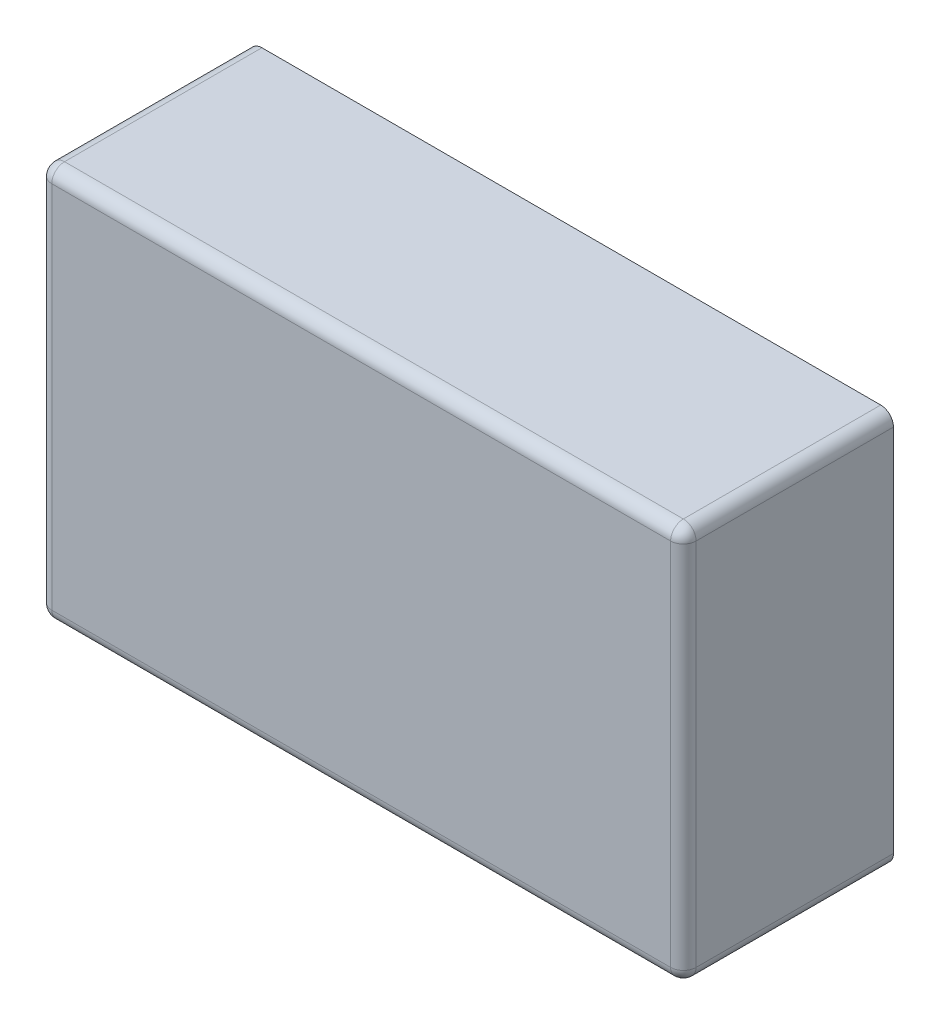
ISO-10303-21;
HEADER;
FILE_DESCRIPTION(('STEP AP214'),'2;1');
FILE_NAME('part.step','',(''),(''),'','','');
FILE_SCHEMA(('AUTOMOTIVE_DESIGN { 1 0 10303 214 1 1 1 1 }'));
ENDSEC;
DATA;
#1=APPLICATION_CONTEXT('core data for automotive mechanical design processes');
#2=APPLICATION_PROTOCOL_DEFINITION('international standard','automotive_design',2000,#1);
#3=PRODUCT_CONTEXT('',#1,'mechanical');
#4=PRODUCT('Part','Part','',(#3));
#5=PRODUCT_RELATED_PRODUCT_CATEGORY('part','',(#4));
#6=PRODUCT_DEFINITION_FORMATION('','',#4);
#7=PRODUCT_DEFINITION_CONTEXT('part definition',#1,'design');
#8=PRODUCT_DEFINITION('design','',#6,#7);
#9=PRODUCT_DEFINITION_SHAPE('','',#8);
#10=(LENGTH_UNIT() NAMED_UNIT(*) SI_UNIT(.MILLI.,.METRE.));
#11=(NAMED_UNIT(*) PLANE_ANGLE_UNIT() SI_UNIT($,.RADIAN.));
#12=(NAMED_UNIT(*) SI_UNIT($,.STERADIAN.) SOLID_ANGLE_UNIT());
#13=UNCERTAINTY_MEASURE_WITH_UNIT(LENGTH_MEASURE(1.E-05),#10,'distance_accuracy_value','');
#14=(GEOMETRIC_REPRESENTATION_CONTEXT(3) GLOBAL_UNCERTAINTY_ASSIGNED_CONTEXT((#13)) GLOBAL_UNIT_ASSIGNED_CONTEXT((#10,
#11,#12)) REPRESENTATION_CONTEXT('',''));
#15=CARTESIAN_POINT('',(0.,0.,0.));
#16=DIRECTION('',(0.,0.,1.));
#17=DIRECTION('',(1.,0.,0.));
#18=AXIS2_PLACEMENT_3D('',#15,#16,#17);
#19=CARTESIAN_POINT('',(0.,0.,82.5));
#20=DIRECTION('',(-1.,0.,0.));
#21=DIRECTION('',(0.,0.,1.));
#22=AXIS2_PLACEMENT_3D('',#19,#20,#21);
#23=PLANE('',#22);
#24=DIRECTION('',(0.,1.,0.));
#25=VECTOR('',#24,1.);
#26=CARTESIAN_POINT('',(0.,20.5,45.));
#27=LINE('',#26,#25);
#28=CARTESIAN_POINT('',(0.,20.5,45.));
#29=VERTEX_POINT('',#28);
#30=CARTESIAN_POINT('',(0.,134.5,45.));
#31=VERTEX_POINT('',#30);
#32=EDGE_CURVE('E200',#29,#31,#27,.T.);
#33=ORIENTED_EDGE('',*,*,#32,.F.);
#34=DIRECTION('',(0.,0.,1.));
#35=VECTOR('',#34,1.);
#36=CARTESIAN_POINT('',(0.,20.5,0.));
#37=LINE('',#36,#35);
#38=CARTESIAN_POINT('',(0.,20.5,0.));
#39=VERTEX_POINT('',#38);
#40=EDGE_CURVE('E208',#39,#29,#37,.T.);
#41=ORIENTED_EDGE('',*,*,#40,.F.);
#42=DIRECTION('',(0.,1.,0.));
#43=VECTOR('',#42,1.);
#44=CARTESIAN_POINT('',(0.,0.,0.));
#45=LINE('',#44,#43);
#46=CARTESIAN_POINT('',(0.,5.,0.));
#47=VERTEX_POINT('',#46);
#48=EDGE_CURVE('E303',#47,#39,#45,.T.);
#49=ORIENTED_EDGE('',*,*,#48,.F.);
#50=DIRECTION('',(0.,0.,-1.));
#51=VECTOR('',#50,1.);
#52=CARTESIAN_POINT('',(0.,5.,82.5));
#53=LINE('',#52,#51);
#54=CARTESIAN_POINT('',(0.,5.,77.5));
#55=VERTEX_POINT('',#54);
#56=EDGE_CURVE('E307',#47,#55,#53,.F.);
#57=ORIENTED_EDGE('',*,*,#56,.T.);
#58=DIRECTION('',(0.,1.,0.));
#59=VECTOR('',#58,1.);
#60=CARTESIAN_POINT('',(0.,0.,77.5));
#61=LINE('',#60,#59);
#62=CARTESIAN_POINT('',(0.,150.,77.5));
#63=VERTEX_POINT('',#62);
#64=EDGE_CURVE('E305',#55,#63,#61,.T.);
#65=ORIENTED_EDGE('',*,*,#64,.T.);
#66=DIRECTION('',(0.,0.,-1.));
#67=VECTOR('',#66,1.);
#68=CARTESIAN_POINT('',(0.,150.,82.5));
#69=LINE('',#68,#67);
#70=CARTESIAN_POINT('',(0.,150.,0.));
#71=VERTEX_POINT('',#70);
#72=EDGE_CURVE('E309',#63,#71,#69,.T.);
#73=ORIENTED_EDGE('',*,*,#72,.T.);
#74=CARTESIAN_POINT('',(0.,134.5,0.));
#75=VERTEX_POINT('',#74);
#76=EDGE_CURVE('E302',#75,#71,#45,.T.);
#77=ORIENTED_EDGE('',*,*,#76,.F.);
#78=DIRECTION('',(0.,0.,1.));
#79=VECTOR('',#78,1.);
#80=CARTESIAN_POINT('',(0.,134.5,0.));
#81=LINE('',#80,#79);
#82=EDGE_CURVE('E217',#75,#31,#81,.T.);
#83=ORIENTED_EDGE('',*,*,#82,.T.);
#84=EDGE_LOOP('',(#33,#41,#49,#57,#65,#73,#77,#83));
#85=FACE_BOUND('',#84,.T.);
#86=ADVANCED_FACE('F34',(#85),#23,.T.);
#87=CARTESIAN_POINT('',(0.,0.,82.5));
#88=DIRECTION('',(0.,1.,0.));
#89=DIRECTION('',(0.,0.,1.));
#90=AXIS2_PLACEMENT_3D('',#87,#88,#89);
#91=PLANE('',#90);
#92=DIRECTION('',(1.,0.,0.));
#93=VECTOR('',#92,1.);
#94=CARTESIAN_POINT('',(0.,0.,0.));
#95=LINE('',#94,#93);
#96=CARTESIAN_POINT('',(5.,0.,0.));
#97=VERTEX_POINT('',#96);
#98=CARTESIAN_POINT('',(248.,0.,0.));
#99=VERTEX_POINT('',#98);
#100=EDGE_CURVE('E292',#97,#99,#95,.T.);
#101=ORIENTED_EDGE('',*,*,#100,.T.);
#102=DIRECTION('',(0.,0.,-1.));
#103=VECTOR('',#102,1.);
#104=CARTESIAN_POINT('',(248.,0.,82.5));
#105=LINE('',#104,#103);
#106=CARTESIAN_POINT('',(248.,0.,77.5));
#107=VERTEX_POINT('',#106);
#108=EDGE_CURVE('E336',#99,#107,#105,.F.);
#109=ORIENTED_EDGE('',*,*,#108,.T.);
#110=DIRECTION('',(1.,0.,0.));
#111=VECTOR('',#110,1.);
#112=CARTESIAN_POINT('',(0.,0.,77.5));
#113=LINE('',#112,#111);
#114=CARTESIAN_POINT('',(5.,0.,77.5));
#115=VERTEX_POINT('',#114);
#116=EDGE_CURVE('E332',#107,#115,#113,.F.);
#117=ORIENTED_EDGE('',*,*,#116,.T.);
#118=DIRECTION('',(0.,0.,-1.));
#119=VECTOR('',#118,1.);
#120=CARTESIAN_POINT('',(5.,0.,0.));
#121=LINE('',#120,#119);
#122=EDGE_CURVE('E334',#115,#97,#121,.T.);
#123=ORIENTED_EDGE('',*,*,#122,.T.);
#124=EDGE_LOOP('',(#101,#109,#117,#123));
#125=FACE_BOUND('',#124,.T.);
#126=ADVANCED_FACE('F469',(#125),#91,.F.);
#127=CARTESIAN_POINT('',(253.,0.,82.5));
#128=DIRECTION('',(-1.,0.,0.));
#129=DIRECTION('',(0.,0.,1.));
#130=AXIS2_PLACEMENT_3D('',#127,#128,#129);
#131=PLANE('',#130);
#132=DIRECTION('',(0.,1.,0.));
#133=VECTOR('',#132,1.);
#134=CARTESIAN_POINT('',(253.,0.,0.));
#135=LINE('',#134,#133);
#136=CARTESIAN_POINT('',(253.,5.,0.));
#137=VERTEX_POINT('',#136);
#138=CARTESIAN_POINT('',(253.,150.,0.));
#139=VERTEX_POINT('',#138);
#140=EDGE_CURVE('E295',#137,#139,#135,.T.);
#141=ORIENTED_EDGE('',*,*,#140,.T.);
#142=DIRECTION('',(0.,0.,-1.));
#143=VECTOR('',#142,1.);
#144=CARTESIAN_POINT('',(253.,150.,82.5));
#145=LINE('',#144,#143);
#146=CARTESIAN_POINT('',(253.,150.,77.5));
#147=VERTEX_POINT('',#146);
#148=EDGE_CURVE('E330',#139,#147,#145,.F.);
#149=ORIENTED_EDGE('',*,*,#148,.T.);
#150=DIRECTION('',(0.,1.,0.));
#151=VECTOR('',#150,1.);
#152=CARTESIAN_POINT('',(253.,0.,77.5));
#153=LINE('',#152,#151);
#154=CARTESIAN_POINT('',(253.,5.,77.5));
#155=VERTEX_POINT('',#154);
#156=EDGE_CURVE('E326',#147,#155,#153,.F.);
#157=ORIENTED_EDGE('',*,*,#156,.T.);
#158=DIRECTION('',(0.,0.,-1.));
#159=VECTOR('',#158,1.);
#160=CARTESIAN_POINT('',(253.,5.,82.5));
#161=LINE('',#160,#159);
#162=EDGE_CURVE('E328',#155,#137,#161,.T.);
#163=ORIENTED_EDGE('',*,*,#162,.T.);
#164=EDGE_LOOP('',(#141,#149,#157,#163));
#165=FACE_BOUND('',#164,.T.);
#166=ADVANCED_FACE('F455',(#165),#131,.F.);
#167=CARTESIAN_POINT('',(0.,155.,82.5));
#168=DIRECTION('',(0.,1.,0.));
#169=DIRECTION('',(0.,0.,1.));
#170=AXIS2_PLACEMENT_3D('',#167,#168,#169);
#171=PLANE('',#170);
#172=DIRECTION('',(1.,0.,0.));
#173=VECTOR('',#172,1.);
#174=CARTESIAN_POINT('',(0.,155.,0.));
#175=LINE('',#174,#173);
#176=CARTESIAN_POINT('',(5.,155.,0.));
#177=VERTEX_POINT('',#176);
#178=CARTESIAN_POINT('',(248.,155.,0.));
#179=VERTEX_POINT('',#178);
#180=EDGE_CURVE('E299',#177,#179,#175,.T.);
#181=ORIENTED_EDGE('',*,*,#180,.F.);
#182=DIRECTION('',(0.,0.,-1.));
#183=VECTOR('',#182,1.);
#184=CARTESIAN_POINT('',(5.,155.,82.5));
#185=LINE('',#184,#183);
#186=CARTESIAN_POINT('',(5.,155.,77.5));
#187=VERTEX_POINT('',#186);
#188=EDGE_CURVE('E324',#177,#187,#185,.F.);
#189=ORIENTED_EDGE('',*,*,#188,.T.);
#190=DIRECTION('',(1.,0.,0.));
#191=VECTOR('',#190,1.);
#192=CARTESIAN_POINT('',(0.,155.,77.5));
#193=LINE('',#192,#191);
#194=CARTESIAN_POINT('',(248.,155.,77.5));
#195=VERTEX_POINT('',#194);
#196=EDGE_CURVE('E320',#187,#195,#193,.T.);
#197=ORIENTED_EDGE('',*,*,#196,.T.);
#198=DIRECTION('',(0.,0.,-1.));
#199=VECTOR('',#198,1.);
#200=CARTESIAN_POINT('',(248.,155.,0.));
#201=LINE('',#200,#199);
#202=EDGE_CURVE('E322',#195,#179,#201,.T.);
#203=ORIENTED_EDGE('',*,*,#202,.T.);
#204=EDGE_LOOP('',(#181,#189,#197,#203));
#205=FACE_BOUND('',#204,.T.);
#206=ADVANCED_FACE('F431',(#205),#171,.T.);
#207=CARTESIAN_POINT('',(0.,0.,82.5));
#208=DIRECTION('',(0.,0.,1.));
#209=DIRECTION('',(1.,0.,0.));
#210=AXIS2_PLACEMENT_3D('',#207,#208,#209);
#211=PLANE('',#210);
#212=DIRECTION('',(1.,0.,0.));
#213=VECTOR('',#212,1.);
#214=CARTESIAN_POINT('',(253.,5.,82.5));
#215=LINE('',#214,#213);
#216=CARTESIAN_POINT('',(5.,5.,82.5));
#217=VERTEX_POINT('',#216);
#218=CARTESIAN_POINT('',(248.,5.,82.5));
#219=VERTEX_POINT('',#218);
#220=EDGE_CURVE('E338',#217,#219,#215,.T.);
#221=ORIENTED_EDGE('',*,*,#220,.T.);
#222=DIRECTION('',(0.,1.,0.));
#223=VECTOR('',#222,1.);
#224=CARTESIAN_POINT('',(248.,155.,82.5));
#225=LINE('',#224,#223);
#226=CARTESIAN_POINT('',(248.,150.,82.5));
#227=VERTEX_POINT('',#226);
#228=EDGE_CURVE('E344',#219,#227,#225,.T.);
#229=ORIENTED_EDGE('',*,*,#228,.T.);
#230=DIRECTION('',(1.,0.,0.));
#231=VECTOR('',#230,1.);
#232=CARTESIAN_POINT('',(0.,150.,82.5));
#233=LINE('',#232,#231);
#234=CARTESIAN_POINT('',(5.,150.,82.5));
#235=VERTEX_POINT('',#234);
#236=EDGE_CURVE('E342',#227,#235,#233,.F.);
#237=ORIENTED_EDGE('',*,*,#236,.T.);
#238=DIRECTION('',(0.,1.,0.));
#239=VECTOR('',#238,1.);
#240=CARTESIAN_POINT('',(5.,0.,82.5));
#241=LINE('',#240,#239);
#242=EDGE_CURVE('E340',#235,#217,#241,.F.);
#243=ORIENTED_EDGE('',*,*,#242,.T.);
#244=EDGE_LOOP('',(#221,#229,#237,#243));
#245=FACE_BOUND('',#244,.T.);
#246=ADVANCED_FACE('F446',(#245),#211,.T.);
#247=CARTESIAN_POINT('',(0.,0.,0.));
#248=DIRECTION('',(0.,0.,1.));
#249=DIRECTION('',(1.,0.,0.));
#250=AXIS2_PLACEMENT_3D('',#247,#248,#249);
#251=PLANE('',#250);
#252=DIRECTION('',(0.,1.,0.));
#253=VECTOR('',#252,1.);
#254=CARTESIAN_POINT('',(2.,5.,0.));
#255=LINE('',#254,#253);
#256=CARTESIAN_POINT('',(2.,5.,0.));
#257=VERTEX_POINT('',#256);
#258=CARTESIAN_POINT('',(2.,150.,0.));
#259=VERTEX_POINT('',#258);
#260=EDGE_CURVE('E255',#257,#259,#255,.T.);
#261=ORIENTED_EDGE('',*,*,#260,.F.);
#262=CARTESIAN_POINT('',(5.,5.,0.));
#263=DIRECTION('',(0.,0.,-1.));
#264=DIRECTION('',(-1.,0.,0.));
#265=AXIS2_PLACEMENT_3D('',#262,#263,#264);
#266=CIRCLE('',#265,3.);
#267=CARTESIAN_POINT('',(5.,2.,0.));
#268=VERTEX_POINT('',#267);
#269=EDGE_CURVE('E204',#268,#257,#266,.T.);
#270=ORIENTED_EDGE('',*,*,#269,.F.);
#271=DIRECTION('',(-1.,0.,0.));
#272=VECTOR('',#271,1.);
#273=CARTESIAN_POINT('',(248.,2.,0.));
#274=LINE('',#273,#272);
#275=CARTESIAN_POINT('',(248.,2.,0.));
#276=VERTEX_POINT('',#275);
#277=EDGE_CURVE('E232',#276,#268,#274,.T.);
#278=ORIENTED_EDGE('',*,*,#277,.F.);
#279=CARTESIAN_POINT('',(248.,5.,0.));
#280=DIRECTION('',(0.,0.,-1.));
#281=DIRECTION('',(-1.,0.,0.));
#282=AXIS2_PLACEMENT_3D('',#279,#280,#281);
#283=CIRCLE('',#282,3.);
#284=CARTESIAN_POINT('',(251.,5.,0.));
#285=VERTEX_POINT('',#284);
#286=EDGE_CURVE('E270',#285,#276,#283,.T.);
#287=ORIENTED_EDGE('',*,*,#286,.F.);
#288=DIRECTION('',(0.,-1.,0.));
#289=VECTOR('',#288,1.);
#290=CARTESIAN_POINT('',(251.,150.,0.));
#291=LINE('',#290,#289);
#292=CARTESIAN_POINT('',(251.,150.,0.));
#293=VERTEX_POINT('',#292);
#294=EDGE_CURVE('E267',#293,#285,#291,.T.);
#295=ORIENTED_EDGE('',*,*,#294,.F.);
#296=CARTESIAN_POINT('',(248.,150.,0.));
#297=DIRECTION('',(0.,0.,-1.));
#298=DIRECTION('',(-1.,0.,0.));
#299=AXIS2_PLACEMENT_3D('',#296,#297,#298);
#300=CIRCLE('',#299,3.);
#301=CARTESIAN_POINT('',(248.,153.,0.));
#302=VERTEX_POINT('',#301);
#303=EDGE_CURVE('E264',#302,#293,#300,.T.);
#304=ORIENTED_EDGE('',*,*,#303,.F.);
#305=DIRECTION('',(1.,0.,0.));
#306=VECTOR('',#305,1.);
#307=CARTESIAN_POINT('',(5.,153.,0.));
#308=LINE('',#307,#306);
#309=CARTESIAN_POINT('',(5.,153.,0.));
#310=VERTEX_POINT('',#309);
#311=EDGE_CURVE('E261',#310,#302,#308,.T.);
#312=ORIENTED_EDGE('',*,*,#311,.F.);
#313=CARTESIAN_POINT('',(5.,150.,0.));
#314=DIRECTION('',(0.,0.,-1.));
#315=DIRECTION('',(-1.,0.,0.));
#316=AXIS2_PLACEMENT_3D('',#313,#314,#315);
#317=CIRCLE('',#316,3.);
#318=EDGE_CURVE('E258',#259,#310,#317,.T.);
#319=ORIENTED_EDGE('',*,*,#318,.F.);
#320=EDGE_LOOP('',(#261,#270,#278,#287,#295,#304,#312,#319));
#321=FACE_BOUND('',#320,.T.);
#322=DIRECTION('',(0.,1.,0.));
#323=VECTOR('',#322,1.);
#324=CARTESIAN_POINT('',(-12.7,20.5,0.));
#325=LINE('',#324,#323);
#326=CARTESIAN_POINT('',(-12.7,23.5,0.));
#327=VERTEX_POINT('',#326);
#328=CARTESIAN_POINT('',(-12.7,131.5,0.));
#329=VERTEX_POINT('',#328);
#330=EDGE_CURVE('E225',#327,#329,#325,.T.);
#331=ORIENTED_EDGE('',*,*,#330,.T.);
#332=CARTESIAN_POINT('',(-9.7,131.5,0.));
#333=DIRECTION('',(0.,0.,1.));
#334=DIRECTION('',(1.,0.,0.));
#335=AXIS2_PLACEMENT_3D('',#332,#333,#334);
#336=CIRCLE('',#335,3.);
#337=CARTESIAN_POINT('',(-9.7,134.5,0.));
#338=VERTEX_POINT('',#337);
#339=EDGE_CURVE('E42',#329,#338,#336,.F.);
#340=ORIENTED_EDGE('',*,*,#339,.T.);
#341=DIRECTION('',(1.,0.,0.));
#342=VECTOR('',#341,1.);
#343=CARTESIAN_POINT('',(-12.7,134.5,0.));
#344=LINE('',#343,#342);
#345=EDGE_CURVE('E224',#338,#75,#344,.T.);
#346=ORIENTED_EDGE('',*,*,#345,.T.);
#347=ORIENTED_EDGE('',*,*,#76,.T.);
#348=CARTESIAN_POINT('',(5.,150.,0.));
#349=DIRECTION('',(0.,0.,1.));
#350=DIRECTION('',(1.,0.,0.));
#351=AXIS2_PLACEMENT_3D('',#348,#349,#350);
#352=CIRCLE('',#351,5.);
#353=EDGE_CURVE('E318',#71,#177,#352,.F.);
#354=ORIENTED_EDGE('',*,*,#353,.T.);
#355=ORIENTED_EDGE('',*,*,#180,.T.);
#356=CARTESIAN_POINT('',(248.,150.,0.));
#357=DIRECTION('',(0.,0.,1.));
#358=DIRECTION('',(1.,0.,0.));
#359=AXIS2_PLACEMENT_3D('',#356,#357,#358);
#360=CIRCLE('',#359,5.);
#361=EDGE_CURVE('E316',#179,#139,#360,.F.);
#362=ORIENTED_EDGE('',*,*,#361,.T.);
#363=ORIENTED_EDGE('',*,*,#140,.F.);
#364=CARTESIAN_POINT('',(248.,5.,0.));
#365=DIRECTION('',(0.,0.,1.));
#366=DIRECTION('',(1.,0.,0.));
#367=AXIS2_PLACEMENT_3D('',#364,#365,#366);
#368=CIRCLE('',#367,5.);
#369=EDGE_CURVE('E314',#137,#99,#368,.F.);
#370=ORIENTED_EDGE('',*,*,#369,.T.);
#371=ORIENTED_EDGE('',*,*,#100,.F.);
#372=CARTESIAN_POINT('',(5.,5.,0.));
#373=DIRECTION('',(0.,0.,1.));
#374=DIRECTION('',(1.,0.,0.));
#375=AXIS2_PLACEMENT_3D('',#372,#373,#374);
#376=CIRCLE('',#375,5.);
#377=EDGE_CURVE('E312',#97,#47,#376,.F.);
#378=ORIENTED_EDGE('',*,*,#377,.T.);
#379=ORIENTED_EDGE('',*,*,#48,.T.);
#380=DIRECTION('',(1.,0.,0.));
#381=VECTOR('',#380,1.);
#382=CARTESIAN_POINT('',(-12.7,20.5,0.));
#383=LINE('',#382,#381);
#384=CARTESIAN_POINT('',(-9.7,20.5,0.));
#385=VERTEX_POINT('',#384);
#386=EDGE_CURVE('E210',#385,#39,#383,.T.);
#387=ORIENTED_EDGE('',*,*,#386,.F.);
#388=CARTESIAN_POINT('',(-9.7,23.5,0.));
#389=DIRECTION('',(0.,0.,1.));
#390=DIRECTION('',(1.,0.,0.));
#391=AXIS2_PLACEMENT_3D('',#388,#389,#390);
#392=CIRCLE('',#391,3.);
#393=EDGE_CURVE('E391',#385,#327,#392,.F.);
#394=ORIENTED_EDGE('',*,*,#393,.T.);
#395=EDGE_LOOP('',(#331,#340,#346,#347,#354,#355,#362,#363,#370,#371,#378,#379,#387,#394));
#396=FACE_BOUND('',#395,.T.);
#397=ADVANCED_FACE('F395',(#321,#396),#251,.F.);
#398=CARTESIAN_POINT('',(248.,5.,82.5));
#399=DIRECTION('',(0.,0.,-1.));
#400=DIRECTION('',(-1.,0.,0.));
#401=AXIS2_PLACEMENT_3D('',#398,#399,#400);
#402=CYLINDRICAL_SURFACE('',#401,5.);
#403=CARTESIAN_POINT('',(248.,5.,77.5));
#404=DIRECTION('',(0.,0.,1.));
#405=DIRECTION('',(1.,0.,0.));
#406=AXIS2_PLACEMENT_3D('',#403,#404,#405);
#407=CIRCLE('',#406,5.);
#408=EDGE_CURVE('E296',#107,#155,#407,.T.);
#409=ORIENTED_EDGE('',*,*,#408,.F.);
#410=ORIENTED_EDGE('',*,*,#108,.F.);
#411=ORIENTED_EDGE('',*,*,#369,.F.);
#412=ORIENTED_EDGE('',*,*,#162,.F.);
#413=EDGE_LOOP('',(#409,#410,#411,#412));
#414=FACE_BOUND('',#413,.T.);
#415=ADVANCED_FACE('F460',(#414),#402,.T.);
#416=CARTESIAN_POINT('',(248.,5.,77.5));
#417=DIRECTION('',(0.,0.,1.));
#418=DIRECTION('',(1.,0.,0.));
#419=AXIS2_PLACEMENT_3D('',#416,#417,#418);
#420=SPHERICAL_SURFACE('',#419,5.);
#421=CARTESIAN_POINT('',(248.,5.,77.5));
#422=DIRECTION('',(1.,0.,0.));
#423=DIRECTION('',(0.,0.,-1.));
#424=AXIS2_PLACEMENT_3D('',#421,#422,#423);
#425=CIRCLE('',#424,5.);
#426=EDGE_CURVE('E374',#107,#219,#425,.F.);
#427=ORIENTED_EDGE('',*,*,#426,.F.);
#428=ORIENTED_EDGE('',*,*,#408,.T.);
#429=CARTESIAN_POINT('',(248.,5.,77.5));
#430=DIRECTION('',(0.,-1.,0.));
#431=DIRECTION('',(0.,0.,-1.));
#432=AXIS2_PLACEMENT_3D('',#429,#430,#431);
#433=CIRCLE('',#432,5.);
#434=EDGE_CURVE('E377',#219,#155,#433,.F.);
#435=ORIENTED_EDGE('',*,*,#434,.F.);
#436=EDGE_LOOP('',(#427,#428,#435));
#437=FACE_BOUND('',#436,.T.);
#438=ADVANCED_FACE('F464',(#437),#420,.T.);
#439=CARTESIAN_POINT('',(248.,150.,82.5));
#440=DIRECTION('',(0.,0.,1.));
#441=DIRECTION('',(1.,0.,0.));
#442=AXIS2_PLACEMENT_3D('',#439,#440,#441);
#443=CYLINDRICAL_SURFACE('',#442,5.);
#444=ORIENTED_EDGE('',*,*,#361,.F.);
#445=ORIENTED_EDGE('',*,*,#202,.F.);
#446=CARTESIAN_POINT('',(248.,150.,77.5));
#447=DIRECTION('',(0.,0.,1.));
#448=DIRECTION('',(1.,0.,0.));
#449=AXIS2_PLACEMENT_3D('',#446,#447,#448);
#450=CIRCLE('',#449,5.);
#451=EDGE_CURVE('E371',#147,#195,#450,.T.);
#452=ORIENTED_EDGE('',*,*,#451,.F.);
#453=ORIENTED_EDGE('',*,*,#148,.F.);
#454=EDGE_LOOP('',(#444,#445,#452,#453));
#455=FACE_BOUND('',#454,.T.);
#456=ADVANCED_FACE('F436',(#455),#443,.T.);
#457=CARTESIAN_POINT('',(248.,0.,77.5));
#458=DIRECTION('',(0.,-1.,0.));
#459=DIRECTION('',(0.,0.,-1.));
#460=AXIS2_PLACEMENT_3D('',#457,#458,#459);
#461=CYLINDRICAL_SURFACE('',#460,5.);
#462=ORIENTED_EDGE('',*,*,#434,.T.);
#463=ORIENTED_EDGE('',*,*,#156,.F.);
#464=CARTESIAN_POINT('',(248.,150.,77.5));
#465=DIRECTION('',(0.,1.,0.));
#466=DIRECTION('',(0.,0.,1.));
#467=AXIS2_PLACEMENT_3D('',#464,#465,#466);
#468=CIRCLE('',#467,5.);
#469=EDGE_CURVE('E368',#227,#147,#468,.T.);
#470=ORIENTED_EDGE('',*,*,#469,.F.);
#471=ORIENTED_EDGE('',*,*,#228,.F.);
#472=EDGE_LOOP('',(#462,#463,#470,#471));
#473=FACE_BOUND('',#472,.T.);
#474=ADVANCED_FACE('F450',(#473),#461,.T.);
#475=CARTESIAN_POINT('',(0.,5.,77.5));
#476=DIRECTION('',(-1.,0.,0.));
#477=DIRECTION('',(0.,0.,1.));
#478=AXIS2_PLACEMENT_3D('',#475,#476,#477);
#479=CYLINDRICAL_SURFACE('',#478,5.);
#480=ORIENTED_EDGE('',*,*,#426,.T.);
#481=ORIENTED_EDGE('',*,*,#220,.F.);
#482=CARTESIAN_POINT('',(5.,5.,77.5));
#483=DIRECTION('',(-1.,0.,0.));
#484=DIRECTION('',(0.,0.,1.));
#485=AXIS2_PLACEMENT_3D('',#482,#483,#484);
#486=CIRCLE('',#485,5.);
#487=EDGE_CURVE('E365',#115,#217,#486,.T.);
#488=ORIENTED_EDGE('',*,*,#487,.F.);
#489=ORIENTED_EDGE('',*,*,#116,.F.);
#490=EDGE_LOOP('',(#480,#481,#488,#489));
#491=FACE_BOUND('',#490,.T.);
#492=ADVANCED_FACE('F467',(#491),#479,.T.);
#493=CARTESIAN_POINT('',(5.,5.,82.5));
#494=DIRECTION('',(0.,0.,1.));
#495=DIRECTION('',(1.,0.,0.));
#496=AXIS2_PLACEMENT_3D('',#493,#494,#495);
#497=CYLINDRICAL_SURFACE('',#496,5.);
#498=ORIENTED_EDGE('',*,*,#377,.F.);
#499=ORIENTED_EDGE('',*,*,#122,.F.);
#500=CARTESIAN_POINT('',(5.,5.,77.5));
#501=DIRECTION('',(0.,0.,1.));
#502=DIRECTION('',(1.,0.,0.));
#503=AXIS2_PLACEMENT_3D('',#500,#501,#502);
#504=CIRCLE('',#503,5.);
#505=EDGE_CURVE('E362',#55,#115,#504,.T.);
#506=ORIENTED_EDGE('',*,*,#505,.F.);
#507=ORIENTED_EDGE('',*,*,#56,.F.);
#508=EDGE_LOOP('',(#498,#499,#506,#507));
#509=FACE_BOUND('',#508,.T.);
#510=ADVANCED_FACE('F411',(#509),#497,.T.);
#511=CARTESIAN_POINT('',(248.,150.,77.5));
#512=DIRECTION('',(0.,0.,1.));
#513=DIRECTION('',(1.,0.,0.));
#514=AXIS2_PLACEMENT_3D('',#511,#512,#513);
#515=SPHERICAL_SURFACE('',#514,5.);
#516=ORIENTED_EDGE('',*,*,#469,.T.);
#517=ORIENTED_EDGE('',*,*,#451,.T.);
#518=CARTESIAN_POINT('',(248.,150.,77.5));
#519=DIRECTION('',(1.,0.,0.));
#520=DIRECTION('',(0.,0.,-1.));
#521=AXIS2_PLACEMENT_3D('',#518,#519,#520);
#522=CIRCLE('',#521,5.);
#523=EDGE_CURVE('E359',#227,#195,#522,.F.);
#524=ORIENTED_EDGE('',*,*,#523,.F.);
#525=EDGE_LOOP('',(#516,#517,#524));
#526=FACE_BOUND('',#525,.T.);
#527=ADVANCED_FACE('F440',(#526),#515,.T.);
#528=CARTESIAN_POINT('',(5.,5.,77.5));
#529=DIRECTION('',(0.,0.,1.));
#530=DIRECTION('',(1.,0.,0.));
#531=AXIS2_PLACEMENT_3D('',#528,#529,#530);
#532=SPHERICAL_SURFACE('',#531,5.);
#533=ORIENTED_EDGE('',*,*,#505,.T.);
#534=ORIENTED_EDGE('',*,*,#487,.T.);
#535=CARTESIAN_POINT('',(5.,5.,77.5));
#536=DIRECTION('',(0.,-1.,0.));
#537=DIRECTION('',(0.,0.,-1.));
#538=AXIS2_PLACEMENT_3D('',#535,#536,#537);
#539=CIRCLE('',#538,5.);
#540=EDGE_CURVE('E356',#55,#217,#539,.F.);
#541=ORIENTED_EDGE('',*,*,#540,.F.);
#542=EDGE_LOOP('',(#533,#534,#541));
#543=FACE_BOUND('',#542,.T.);
#544=ADVANCED_FACE('F417',(#543),#532,.T.);
#545=CARTESIAN_POINT('',(0.,150.,77.5));
#546=DIRECTION('',(1.,0.,0.));
#547=DIRECTION('',(0.,0.,-1.));
#548=AXIS2_PLACEMENT_3D('',#545,#546,#547);
#549=CYLINDRICAL_SURFACE('',#548,5.);
#550=ORIENTED_EDGE('',*,*,#523,.T.);
#551=ORIENTED_EDGE('',*,*,#196,.F.);
#552=CARTESIAN_POINT('',(5.,150.,77.5));
#553=DIRECTION('',(-1.,0.,0.));
#554=DIRECTION('',(0.,0.,1.));
#555=AXIS2_PLACEMENT_3D('',#552,#553,#554);
#556=CIRCLE('',#555,5.);
#557=EDGE_CURVE('E353',#235,#187,#556,.T.);
#558=ORIENTED_EDGE('',*,*,#557,.F.);
#559=ORIENTED_EDGE('',*,*,#236,.F.);
#560=EDGE_LOOP('',(#550,#551,#558,#559));
#561=FACE_BOUND('',#560,.T.);
#562=ADVANCED_FACE('F443',(#561),#549,.T.);
#563=CARTESIAN_POINT('',(5.,0.,77.5));
#564=DIRECTION('',(0.,1.,0.));
#565=DIRECTION('',(0.,0.,1.));
#566=AXIS2_PLACEMENT_3D('',#563,#564,#565);
#567=CYLINDRICAL_SURFACE('',#566,5.);
#568=ORIENTED_EDGE('',*,*,#540,.T.);
#569=ORIENTED_EDGE('',*,*,#242,.F.);
#570=CARTESIAN_POINT('',(5.,150.,77.5));
#571=DIRECTION('',(0.,1.,0.));
#572=DIRECTION('',(0.,0.,1.));
#573=AXIS2_PLACEMENT_3D('',#570,#571,#572);
#574=CIRCLE('',#573,5.);
#575=EDGE_CURVE('E350',#63,#235,#574,.T.);
#576=ORIENTED_EDGE('',*,*,#575,.F.);
#577=ORIENTED_EDGE('',*,*,#64,.F.);
#578=EDGE_LOOP('',(#568,#569,#576,#577));
#579=FACE_BOUND('',#578,.T.);
#580=ADVANCED_FACE('F421',(#579),#567,.T.);
#581=CARTESIAN_POINT('',(5.,150.,77.5));
#582=DIRECTION('',(0.,0.,1.));
#583=DIRECTION('',(1.,0.,0.));
#584=AXIS2_PLACEMENT_3D('',#581,#582,#583);
#585=SPHERICAL_SURFACE('',#584,5.);
#586=ORIENTED_EDGE('',*,*,#575,.T.);
#587=ORIENTED_EDGE('',*,*,#557,.T.);
#588=CARTESIAN_POINT('',(5.,150.,77.5));
#589=DIRECTION('',(0.,0.,1.));
#590=DIRECTION('',(1.,0.,0.));
#591=AXIS2_PLACEMENT_3D('',#588,#589,#590);
#592=CIRCLE('',#591,5.);
#593=EDGE_CURVE('E277',#63,#187,#592,.F.);
#594=ORIENTED_EDGE('',*,*,#593,.F.);
#595=EDGE_LOOP('',(#586,#587,#594));
#596=FACE_BOUND('',#595,.T.);
#597=ADVANCED_FACE('F483',(#596),#585,.T.);
#598=CARTESIAN_POINT('',(5.,150.,82.5));
#599=DIRECTION('',(0.,0.,-1.));
#600=DIRECTION('',(-1.,0.,0.));
#601=AXIS2_PLACEMENT_3D('',#598,#599,#600);
#602=CYLINDRICAL_SURFACE('',#601,5.);
#603=ORIENTED_EDGE('',*,*,#593,.T.);
#604=ORIENTED_EDGE('',*,*,#188,.F.);
#605=ORIENTED_EDGE('',*,*,#353,.F.);
#606=ORIENTED_EDGE('',*,*,#72,.F.);
#607=EDGE_LOOP('',(#603,#604,#605,#606));
#608=FACE_BOUND('',#607,.T.);
#609=ADVANCED_FACE('F426',(#608),#602,.T.);
#610=CARTESIAN_POINT('',(5.,5.,6.3));
#611=DIRECTION('',(0.,0.,-1.));
#612=DIRECTION('',(-1.,0.,0.));
#613=AXIS2_PLACEMENT_3D('',#610,#611,#612);
#614=CYLINDRICAL_SURFACE('',#613,3.);
#615=ORIENTED_EDGE('',*,*,#269,.T.);
#616=DIRECTION('',(0.,0.,-1.));
#617=VECTOR('',#616,1.);
#618=CARTESIAN_POINT('',(2.,5.,6.3));
#619=LINE('',#618,#617);
#620=CARTESIAN_POINT('',(2.,5.,6.3));
#621=VERTEX_POINT('',#620);
#622=EDGE_CURVE('E253',#621,#257,#619,.T.);
#623=ORIENTED_EDGE('',*,*,#622,.F.);
#624=CARTESIAN_POINT('',(5.,5.,6.3));
#625=DIRECTION('',(0.,0.,-1.));
#626=DIRECTION('',(-1.,0.,0.));
#627=AXIS2_PLACEMENT_3D('',#624,#625,#626);
#628=CIRCLE('',#627,3.);
#629=CARTESIAN_POINT('',(5.,2.,6.3));
#630=VERTEX_POINT('',#629);
#631=EDGE_CURVE('E228',#630,#621,#628,.T.);
#632=ORIENTED_EDGE('',*,*,#631,.F.);
#633=DIRECTION('',(0.,0.,-1.));
#634=VECTOR('',#633,1.);
#635=CARTESIAN_POINT('',(5.,2.,6.3));
#636=LINE('',#635,#634);
#637=EDGE_CURVE('E275',#630,#268,#636,.T.);
#638=ORIENTED_EDGE('',*,*,#637,.T.);
#639=EDGE_LOOP('',(#615,#623,#632,#638));
#640=FACE_BOUND('',#639,.T.);
#641=ADVANCED_FACE('F482',(#640),#614,.F.);
#642=CARTESIAN_POINT('',(248.,2.,6.3));
#643=DIRECTION('',(0.,-1.,0.));
#644=DIRECTION('',(1.,0.,0.));
#645=AXIS2_PLACEMENT_3D('',#642,#643,#644);
#646=PLANE('',#645);
#647=ORIENTED_EDGE('',*,*,#277,.T.);
#648=ORIENTED_EDGE('',*,*,#637,.F.);
#649=DIRECTION('',(-1.,0.,0.));
#650=VECTOR('',#649,1.);
#651=CARTESIAN_POINT('',(248.,2.,6.3));
#652=LINE('',#651,#650);
#653=CARTESIAN_POINT('',(248.,2.,6.3));
#654=VERTEX_POINT('',#653);
#655=EDGE_CURVE('E250',#654,#630,#652,.T.);
#656=ORIENTED_EDGE('',*,*,#655,.F.);
#657=DIRECTION('',(0.,0.,-1.));
#658=VECTOR('',#657,1.);
#659=CARTESIAN_POINT('',(248.,2.,6.3));
#660=LINE('',#659,#658);
#661=EDGE_CURVE('E278',#654,#276,#660,.T.);
#662=ORIENTED_EDGE('',*,*,#661,.T.);
#663=EDGE_LOOP('',(#647,#648,#656,#662));
#664=FACE_BOUND('',#663,.T.);
#665=ADVANCED_FACE('F526',(#664),#646,.F.);
#666=CARTESIAN_POINT('',(248.,5.,6.3));
#667=DIRECTION('',(0.,0.,-1.));
#668=DIRECTION('',(-1.,0.,0.));
#669=AXIS2_PLACEMENT_3D('',#666,#667,#668);
#670=CYLINDRICAL_SURFACE('',#669,3.);
#671=ORIENTED_EDGE('',*,*,#286,.T.);
#672=ORIENTED_EDGE('',*,*,#661,.F.);
#673=CARTESIAN_POINT('',(248.,5.,6.3));
#674=DIRECTION('',(0.,0.,-1.));
#675=DIRECTION('',(-1.,0.,0.));
#676=AXIS2_PLACEMENT_3D('',#673,#674,#675);
#677=CIRCLE('',#676,3.);
#678=CARTESIAN_POINT('',(251.,5.,6.3));
#679=VERTEX_POINT('',#678);
#680=EDGE_CURVE('E247',#679,#654,#677,.T.);
#681=ORIENTED_EDGE('',*,*,#680,.F.);
#682=DIRECTION('',(0.,0.,-1.));
#683=VECTOR('',#682,1.);
#684=CARTESIAN_POINT('',(251.,5.,6.3));
#685=LINE('',#684,#683);
#686=EDGE_CURVE('E280',#679,#285,#685,.T.);
#687=ORIENTED_EDGE('',*,*,#686,.T.);
#688=EDGE_LOOP('',(#671,#672,#681,#687));
#689=FACE_BOUND('',#688,.T.);
#690=ADVANCED_FACE('F529',(#689),#670,.F.);
#691=CARTESIAN_POINT('',(251.,150.,6.3));
#692=DIRECTION('',(1.,0.,0.));
#693=DIRECTION('',(0.,0.,-1.));
#694=AXIS2_PLACEMENT_3D('',#691,#692,#693);
#695=PLANE('',#694);
#696=ORIENTED_EDGE('',*,*,#294,.T.);
#697=ORIENTED_EDGE('',*,*,#686,.F.);
#698=DIRECTION('',(0.,-1.,0.));
#699=VECTOR('',#698,1.);
#700=CARTESIAN_POINT('',(251.,150.,6.3));
#701=LINE('',#700,#699);
#702=CARTESIAN_POINT('',(251.,150.,6.3));
#703=VERTEX_POINT('',#702);
#704=EDGE_CURVE('E244',#703,#679,#701,.T.);
#705=ORIENTED_EDGE('',*,*,#704,.F.);
#706=DIRECTION('',(0.,0.,-1.));
#707=VECTOR('',#706,1.);
#708=CARTESIAN_POINT('',(251.,150.,6.3));
#709=LINE('',#708,#707);
#710=EDGE_CURVE('E282',#703,#293,#709,.T.);
#711=ORIENTED_EDGE('',*,*,#710,.T.);
#712=EDGE_LOOP('',(#696,#697,#705,#711));
#713=FACE_BOUND('',#712,.T.);
#714=ADVANCED_FACE('F533',(#713),#695,.F.);
#715=CARTESIAN_POINT('',(248.,150.,6.3));
#716=DIRECTION('',(0.,0.,-1.));
#717=DIRECTION('',(-1.,0.,0.));
#718=AXIS2_PLACEMENT_3D('',#715,#716,#717);
#719=CYLINDRICAL_SURFACE('',#718,3.);
#720=ORIENTED_EDGE('',*,*,#303,.T.);
#721=ORIENTED_EDGE('',*,*,#710,.F.);
#722=CARTESIAN_POINT('',(248.,150.,6.3));
#723=DIRECTION('',(0.,0.,-1.));
#724=DIRECTION('',(-1.,0.,0.));
#725=AXIS2_PLACEMENT_3D('',#722,#723,#724);
#726=CIRCLE('',#725,3.);
#727=CARTESIAN_POINT('',(248.,153.,6.3));
#728=VERTEX_POINT('',#727);
#729=EDGE_CURVE('E241',#728,#703,#726,.T.);
#730=ORIENTED_EDGE('',*,*,#729,.F.);
#731=DIRECTION('',(0.,0.,-1.));
#732=VECTOR('',#731,1.);
#733=CARTESIAN_POINT('',(248.,153.,6.3));
#734=LINE('',#733,#732);
#735=EDGE_CURVE('E284',#728,#302,#734,.T.);
#736=ORIENTED_EDGE('',*,*,#735,.T.);
#737=EDGE_LOOP('',(#720,#721,#730,#736));
#738=FACE_BOUND('',#737,.T.);
#739=ADVANCED_FACE('F537',(#738),#719,.F.);
#740=CARTESIAN_POINT('',(5.,153.,6.3));
#741=DIRECTION('',(0.,1.,0.));
#742=DIRECTION('',(0.,0.,1.));
#743=AXIS2_PLACEMENT_3D('',#740,#741,#742);
#744=PLANE('',#743);
#745=ORIENTED_EDGE('',*,*,#311,.T.);
#746=ORIENTED_EDGE('',*,*,#735,.F.);
#747=DIRECTION('',(1.,0.,0.));
#748=VECTOR('',#747,1.);
#749=CARTESIAN_POINT('',(5.,153.,6.3));
#750=LINE('',#749,#748);
#751=CARTESIAN_POINT('',(5.,153.,6.3));
#752=VERTEX_POINT('',#751);
#753=EDGE_CURVE('E238',#752,#728,#750,.T.);
#754=ORIENTED_EDGE('',*,*,#753,.F.);
#755=DIRECTION('',(0.,0.,-1.));
#756=VECTOR('',#755,1.);
#757=CARTESIAN_POINT('',(5.,153.,6.3));
#758=LINE('',#757,#756);
#759=EDGE_CURVE('E286',#752,#310,#758,.T.);
#760=ORIENTED_EDGE('',*,*,#759,.T.);
#761=EDGE_LOOP('',(#745,#746,#754,#760));
#762=FACE_BOUND('',#761,.T.);
#763=ADVANCED_FACE('F541',(#762),#744,.F.);
#764=CARTESIAN_POINT('',(5.,150.,6.3));
#765=DIRECTION('',(0.,0.,-1.));
#766=DIRECTION('',(-1.,0.,0.));
#767=AXIS2_PLACEMENT_3D('',#764,#765,#766);
#768=CYLINDRICAL_SURFACE('',#767,3.);
#769=ORIENTED_EDGE('',*,*,#318,.T.);
#770=ORIENTED_EDGE('',*,*,#759,.F.);
#771=CARTESIAN_POINT('',(5.,150.,6.3));
#772=DIRECTION('',(0.,0.,-1.));
#773=DIRECTION('',(-1.,0.,0.));
#774=AXIS2_PLACEMENT_3D('',#771,#772,#773);
#775=CIRCLE('',#774,3.);
#776=CARTESIAN_POINT('',(2.,150.,6.3));
#777=VERTEX_POINT('',#776);
#778=EDGE_CURVE('E235',#777,#752,#775,.T.);
#779=ORIENTED_EDGE('',*,*,#778,.F.);
#780=DIRECTION('',(0.,0.,-1.));
#781=VECTOR('',#780,1.);
#782=CARTESIAN_POINT('',(2.,150.,6.3));
#783=LINE('',#782,#781);
#784=EDGE_CURVE('E288',#777,#259,#783,.T.);
#785=ORIENTED_EDGE('',*,*,#784,.T.);
#786=EDGE_LOOP('',(#769,#770,#779,#785));
#787=FACE_BOUND('',#786,.T.);
#788=ADVANCED_FACE('F545',(#787),#768,.F.);
#789=CARTESIAN_POINT('',(2.,5.,6.3));
#790=DIRECTION('',(-1.,0.,0.));
#791=DIRECTION('',(0.,0.,1.));
#792=AXIS2_PLACEMENT_3D('',#789,#790,#791);
#793=PLANE('',#792);
#794=ORIENTED_EDGE('',*,*,#260,.T.);
#795=ORIENTED_EDGE('',*,*,#784,.F.);
#796=DIRECTION('',(0.,1.,0.));
#797=VECTOR('',#796,1.);
#798=CARTESIAN_POINT('',(2.,5.,6.3));
#799=LINE('',#798,#797);
#800=EDGE_CURVE('E231',#621,#777,#799,.T.);
#801=ORIENTED_EDGE('',*,*,#800,.F.);
#802=ORIENTED_EDGE('',*,*,#622,.T.);
#803=EDGE_LOOP('',(#794,#795,#801,#802));
#804=FACE_BOUND('',#803,.T.);
#805=ADVANCED_FACE('F524',(#804),#793,.F.);
#806=CARTESIAN_POINT('',(5.,5.,6.3));
#807=DIRECTION('',(0.,0.,-1.));
#808=DIRECTION('',(-1.,0.,0.));
#809=AXIS2_PLACEMENT_3D('',#806,#807,#808);
#810=PLANE('',#809);
#811=ORIENTED_EDGE('',*,*,#631,.T.);
#812=ORIENTED_EDGE('',*,*,#800,.T.);
#813=ORIENTED_EDGE('',*,*,#778,.T.);
#814=ORIENTED_EDGE('',*,*,#753,.T.);
#815=ORIENTED_EDGE('',*,*,#729,.T.);
#816=ORIENTED_EDGE('',*,*,#704,.T.);
#817=ORIENTED_EDGE('',*,*,#680,.T.);
#818=ORIENTED_EDGE('',*,*,#655,.T.);
#819=EDGE_LOOP('',(#811,#812,#813,#814,#815,#816,#817,#818));
#820=FACE_BOUND('',#819,.T.);
#821=ADVANCED_FACE('F521',(#820),#810,.T.);
#822=CARTESIAN_POINT('',(-12.7,20.5,0.));
#823=DIRECTION('',(0.,1.,0.));
#824=DIRECTION('',(0.,0.,1.));
#825=AXIS2_PLACEMENT_3D('',#822,#823,#824);
#826=PLANE('',#825);
#827=DIRECTION('',(1.,0.,0.));
#828=VECTOR('',#827,1.);
#829=CARTESIAN_POINT('',(-12.7,20.5,45.));
#830=LINE('',#829,#828);
#831=CARTESIAN_POINT('',(-9.7,20.5,45.));
#832=VERTEX_POINT('',#831);
#833=EDGE_CURVE('E195',#832,#29,#830,.T.);
#834=ORIENTED_EDGE('',*,*,#833,.F.);
#835=DIRECTION('',(0.,0.,1.));
#836=VECTOR('',#835,1.);
#837=CARTESIAN_POINT('',(-9.7,20.5,0.));
#838=LINE('',#837,#836);
#839=EDGE_CURVE('E11',#832,#385,#838,.F.);
#840=ORIENTED_EDGE('',*,*,#839,.T.);
#841=ORIENTED_EDGE('',*,*,#386,.T.);
#842=ORIENTED_EDGE('',*,*,#40,.T.);
#843=EDGE_LOOP('',(#834,#840,#841,#842));
#844=FACE_BOUND('',#843,.T.);
#845=ADVANCED_FACE('F209',(#844),#826,.F.);
#846=CARTESIAN_POINT('',(-12.7,20.5,45.));
#847=DIRECTION('',(0.,0.,-1.));
#848=DIRECTION('',(-1.,0.,0.));
#849=AXIS2_PLACEMENT_3D('',#846,#847,#848);
#850=PLANE('',#849);
#851=DIRECTION('',(1.,0.,0.));
#852=VECTOR('',#851,1.);
#853=CARTESIAN_POINT('',(-12.7,134.5,45.));
#854=LINE('',#853,#852);
#855=CARTESIAN_POINT('',(-9.7,134.5,45.));
#856=VERTEX_POINT('',#855);
#857=EDGE_CURVE('E205',#856,#31,#854,.T.);
#858=ORIENTED_EDGE('',*,*,#857,.F.);
#859=CARTESIAN_POINT('',(-9.7,131.5,45.));
#860=DIRECTION('',(0.,0.,-1.));
#861=DIRECTION('',(-1.,0.,0.));
#862=AXIS2_PLACEMENT_3D('',#859,#860,#861);
#863=CIRCLE('',#862,3.);
#864=CARTESIAN_POINT('',(-12.7,131.5,45.));
#865=VERTEX_POINT('',#864);
#866=EDGE_CURVE('E385',#856,#865,#863,.F.);
#867=ORIENTED_EDGE('',*,*,#866,.T.);
#868=DIRECTION('',(0.,1.,0.));
#869=VECTOR('',#868,1.);
#870=CARTESIAN_POINT('',(-12.7,20.5,45.));
#871=LINE('',#870,#869);
#872=CARTESIAN_POINT('',(-12.7,23.5,45.));
#873=VERTEX_POINT('',#872);
#874=EDGE_CURVE('E219',#873,#865,#871,.T.);
#875=ORIENTED_EDGE('',*,*,#874,.F.);
#876=CARTESIAN_POINT('',(-9.7,23.5,45.));
#877=DIRECTION('',(0.,0.,-1.));
#878=DIRECTION('',(-1.,0.,0.));
#879=AXIS2_PLACEMENT_3D('',#876,#877,#878);
#880=CIRCLE('',#879,3.);
#881=EDGE_CURVE('E203',#873,#832,#880,.F.);
#882=ORIENTED_EDGE('',*,*,#881,.T.);
#883=ORIENTED_EDGE('',*,*,#833,.T.);
#884=ORIENTED_EDGE('',*,*,#32,.T.);
#885=EDGE_LOOP('',(#858,#867,#875,#882,#883,#884));
#886=FACE_BOUND('',#885,.T.);
#887=ADVANCED_FACE('F198',(#886),#850,.F.);
#888=CARTESIAN_POINT('',(-12.7,134.5,0.));
#889=DIRECTION('',(0.,1.,0.));
#890=DIRECTION('',(0.,0.,1.));
#891=AXIS2_PLACEMENT_3D('',#888,#889,#890);
#892=PLANE('',#891);
#893=ORIENTED_EDGE('',*,*,#345,.F.);
#894=DIRECTION('',(0.,0.,1.));
#895=VECTOR('',#894,1.);
#896=CARTESIAN_POINT('',(-9.7,134.5,0.));
#897=LINE('',#896,#895);
#898=EDGE_CURVE('E347',#338,#856,#897,.T.);
#899=ORIENTED_EDGE('',*,*,#898,.T.);
#900=ORIENTED_EDGE('',*,*,#857,.T.);
#901=ORIENTED_EDGE('',*,*,#82,.F.);
#902=EDGE_LOOP('',(#893,#899,#900,#901));
#903=FACE_BOUND('',#902,.T.);
#904=ADVANCED_FACE('F399',(#903),#892,.T.);
#905=CARTESIAN_POINT('',(-12.7,0.,0.));
#906=DIRECTION('',(-1.,0.,0.));
#907=DIRECTION('',(0.,0.,1.));
#908=AXIS2_PLACEMENT_3D('',#905,#906,#907);
#909=PLANE('',#908);
#910=ORIENTED_EDGE('',*,*,#874,.T.);
#911=DIRECTION('',(0.,0.,1.));
#912=VECTOR('',#911,1.);
#913=CARTESIAN_POINT('',(-12.7,131.5,0.));
#914=LINE('',#913,#912);
#915=EDGE_CURVE('E55',#865,#329,#914,.F.);
#916=ORIENTED_EDGE('',*,*,#915,.T.);
#917=ORIENTED_EDGE('',*,*,#330,.F.);
#918=DIRECTION('',(0.,0.,1.));
#919=VECTOR('',#918,1.);
#920=CARTESIAN_POINT('',(-12.7,23.5,45.));
#921=LINE('',#920,#919);
#922=EDGE_CURVE('E387',#327,#873,#921,.T.);
#923=ORIENTED_EDGE('',*,*,#922,.T.);
#924=EDGE_LOOP('',(#910,#916,#917,#923));
#925=FACE_BOUND('',#924,.T.);
#926=ADVANCED_FACE('F401',(#925),#909,.T.);
#927=CARTESIAN_POINT('',(-9.7,131.5,0.));
#928=DIRECTION('',(0.,0.,1.));
#929=DIRECTION('',(1.,0.,0.));
#930=AXIS2_PLACEMENT_3D('',#927,#928,#929);
#931=CYLINDRICAL_SURFACE('',#930,3.);
#932=ORIENTED_EDGE('',*,*,#339,.F.);
#933=ORIENTED_EDGE('',*,*,#915,.F.);
#934=ORIENTED_EDGE('',*,*,#866,.F.);
#935=ORIENTED_EDGE('',*,*,#898,.F.);
#936=EDGE_LOOP('',(#932,#933,#934,#935));
#937=FACE_BOUND('',#936,.T.);
#938=ADVANCED_FACE('F400',(#937),#931,.T.);
#939=CARTESIAN_POINT('',(-9.7,23.5,0.));
#940=DIRECTION('',(0.,0.,-1.));
#941=DIRECTION('',(-1.,0.,0.));
#942=AXIS2_PLACEMENT_3D('',#939,#940,#941);
#943=CYLINDRICAL_SURFACE('',#942,3.);
#944=ORIENTED_EDGE('',*,*,#393,.F.);
#945=ORIENTED_EDGE('',*,*,#839,.F.);
#946=ORIENTED_EDGE('',*,*,#881,.F.);
#947=ORIENTED_EDGE('',*,*,#922,.F.);
#948=EDGE_LOOP('',(#944,#945,#946,#947));
#949=FACE_BOUND('',#948,.T.);
#950=ADVANCED_FACE('F36',(#949),#943,.T.);
#951=CLOSED_SHELL('',(#86,#126,#166,#206,#246,#397,#415,#438,#456,#474,#492,#510,#527,#544,#562,
#580,#597,#609,#641,#665,#690,#714,#739,#763,#788,#805,#821,#845,#887,#904,#926,#938,#950));
#952=MANIFOLD_SOLID_BREP('B2',#951);
#953=ADVANCED_BREP_SHAPE_REPRESENTATION('',(#18,#952),#14);
#954=SHAPE_DEFINITION_REPRESENTATION(#9,#953);
ENDSEC;
END-ISO-10303-21;
